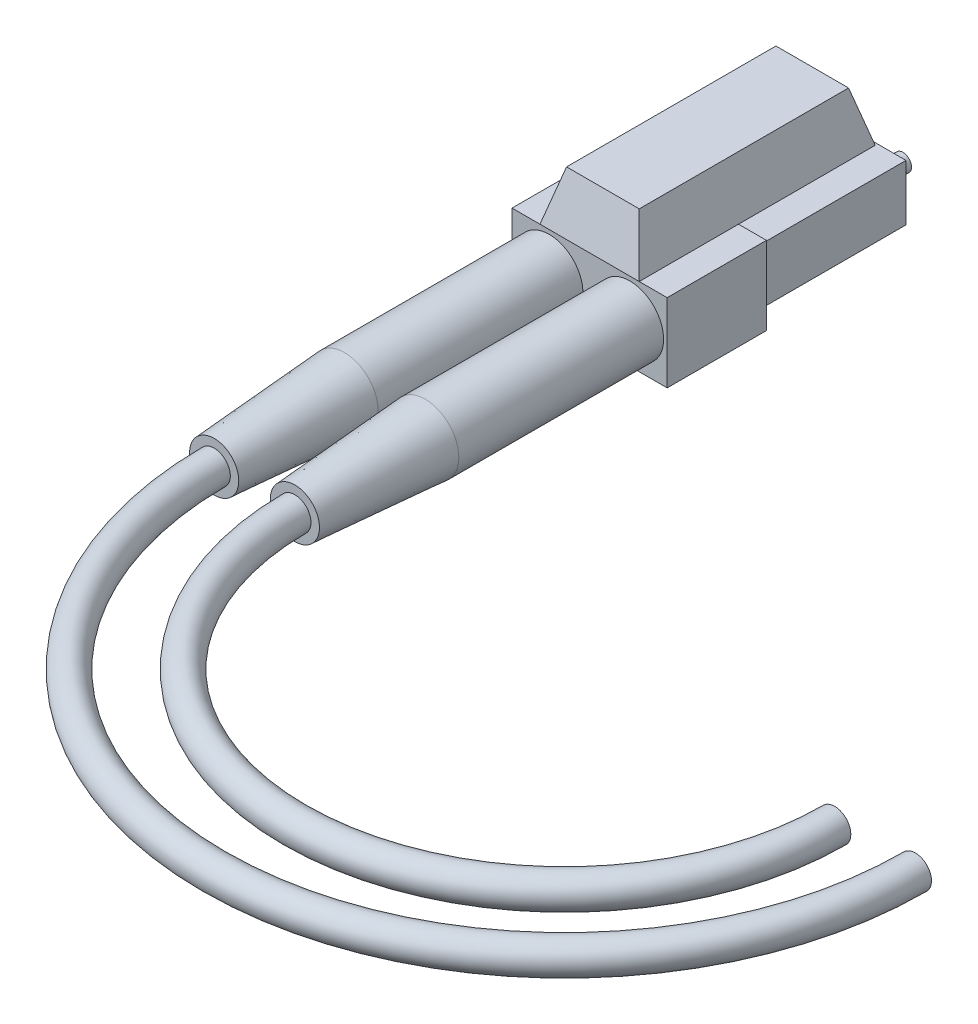
ISO-10303-21;
HEADER;
FILE_DESCRIPTION(('STEP AP214'),'2;1');
FILE_NAME('part.step','',(''),(''),'','','');
FILE_SCHEMA(('AUTOMOTIVE_DESIGN { 1 0 10303 214 1 1 1 1 }'));
ENDSEC;
DATA;
#1=APPLICATION_CONTEXT('core data for automotive mechanical design processes');
#2=APPLICATION_PROTOCOL_DEFINITION('international standard','automotive_design',2000,#1);
#3=PRODUCT_CONTEXT('',#1,'mechanical');
#4=PRODUCT('Part','Part','',(#3));
#5=PRODUCT_RELATED_PRODUCT_CATEGORY('part','',(#4));
#6=PRODUCT_DEFINITION_FORMATION('','',#4);
#7=PRODUCT_DEFINITION_CONTEXT('part definition',#1,'design');
#8=PRODUCT_DEFINITION('design','',#6,#7);
#9=PRODUCT_DEFINITION_SHAPE('','',#8);
#10=(LENGTH_UNIT() NAMED_UNIT(*) SI_UNIT(.MILLI.,.METRE.));
#11=(NAMED_UNIT(*) PLANE_ANGLE_UNIT() SI_UNIT($,.RADIAN.));
#12=(NAMED_UNIT(*) SI_UNIT($,.STERADIAN.) SOLID_ANGLE_UNIT());
#13=UNCERTAINTY_MEASURE_WITH_UNIT(LENGTH_MEASURE(1.E-05),#10,'distance_accuracy_value','');
#14=(GEOMETRIC_REPRESENTATION_CONTEXT(3) GLOBAL_UNCERTAINTY_ASSIGNED_CONTEXT((#13)) GLOBAL_UNIT_ASSIGNED_CONTEXT((#10,
#11,#12)) REPRESENTATION_CONTEXT('',''));
#15=CARTESIAN_POINT('',(0.,0.,0.));
#16=DIRECTION('',(0.,0.,1.));
#17=DIRECTION('',(1.,0.,0.));
#18=AXIS2_PLACEMENT_3D('',#15,#16,#17);
#19=CARTESIAN_POINT('',(-6.25,5.3,8.));
#20=DIRECTION('',(0.,1.,0.));
#21=DIRECTION('',(0.,0.,1.));
#22=AXIS2_PLACEMENT_3D('',#19,#20,#21);
#23=PLANE('',#22);
#24=DIRECTION('',(0.,0.,-1.));
#25=VECTOR('',#24,1.);
#26=CARTESIAN_POINT('',(4.,5.3,8.));
#27=LINE('',#26,#25);
#28=CARTESIAN_POINT('',(4.,5.3,8.));
#29=VERTEX_POINT('',#28);
#30=CARTESIAN_POINT('',(4.,5.3,0.));
#31=VERTEX_POINT('',#30);
#32=EDGE_CURVE('E49',#29,#31,#27,.T.);
#33=ORIENTED_EDGE('',*,*,#32,.F.);
#34=DIRECTION('',(1.,0.,0.));
#35=VECTOR('',#34,1.);
#36=CARTESIAN_POINT('',(-6.25,5.3,8.));
#37=LINE('',#36,#35);
#38=CARTESIAN_POINT('',(6.25,5.3,8.));
#39=VERTEX_POINT('',#38);
#40=EDGE_CURVE('E245',#29,#39,#37,.T.);
#41=ORIENTED_EDGE('',*,*,#40,.T.);
#42=DIRECTION('',(0.,0.,-1.));
#43=VECTOR('',#42,1.);
#44=CARTESIAN_POINT('',(6.25,5.3,8.));
#45=LINE('',#44,#43);
#46=CARTESIAN_POINT('',(6.25,5.3,0.));
#47=VERTEX_POINT('',#46);
#48=EDGE_CURVE('E306',#39,#47,#45,.T.);
#49=ORIENTED_EDGE('',*,*,#48,.T.);
#50=DIRECTION('',(1.,0.,0.));
#51=VECTOR('',#50,1.);
#52=CARTESIAN_POINT('',(-6.25,5.3,0.));
#53=LINE('',#52,#51);
#54=EDGE_CURVE('E54',#31,#47,#53,.T.);
#55=ORIENTED_EDGE('',*,*,#54,.F.);
#56=EDGE_LOOP('',(#33,#41,#49,#55));
#57=FACE_BOUND('',#56,.T.);
#58=ADVANCED_FACE('F32',(#57),#23,.T.);
#59=CARTESIAN_POINT('',(0.,0.,8.));
#60=DIRECTION('',(0.,0.,-1.));
#61=DIRECTION('',(-1.,0.,0.));
#62=AXIS2_PLACEMENT_3D('',#59,#60,#61);
#63=PLANE('',#62);
#64=CARTESIAN_POINT('',(3.25,2.25,8.));
#65=DIRECTION('',(0.,0.,-1.));
#66=DIRECTION('',(-1.,0.,0.));
#67=AXIS2_PLACEMENT_3D('',#64,#65,#66);
#68=CIRCLE('',#67,2.715);
#69=CARTESIAN_POINT('',(0.534999999999999,2.25,8.));
#70=VERTEX_POINT('',#69);
#71=EDGE_CURVE('E261',#70,#70,#68,.F.);
#72=ORIENTED_EDGE('',*,*,#71,.F.);
#73=EDGE_LOOP('',(#72));
#74=FACE_BOUND('',#73,.T.);
#75=DIRECTION('',(0.,1.,0.));
#76=VECTOR('',#75,1.);
#77=CARTESIAN_POINT('',(-6.25,-1.,8.));
#78=LINE('',#77,#76);
#79=CARTESIAN_POINT('',(-6.25,-1.,8.));
#80=VERTEX_POINT('',#79);
#81=CARTESIAN_POINT('',(-6.25,5.3,8.));
#82=VERTEX_POINT('',#81);
#83=EDGE_CURVE('E242',#80,#82,#78,.T.);
#84=ORIENTED_EDGE('',*,*,#83,.F.);
#85=DIRECTION('',(1.,0.,0.));
#86=VECTOR('',#85,1.);
#87=CARTESIAN_POINT('',(-6.25,-1.,8.));
#88=LINE('',#87,#86);
#89=CARTESIAN_POINT('',(6.25,-1.,8.));
#90=VERTEX_POINT('',#89);
#91=EDGE_CURVE('E307',#80,#90,#88,.T.);
#92=ORIENTED_EDGE('',*,*,#91,.T.);
#93=DIRECTION('',(0.,1.,0.));
#94=VECTOR('',#93,1.);
#95=CARTESIAN_POINT('',(6.25,-1.,8.));
#96=LINE('',#95,#94);
#97=EDGE_CURVE('E249',#90,#39,#96,.T.);
#98=ORIENTED_EDGE('',*,*,#97,.T.);
#99=ORIENTED_EDGE('',*,*,#40,.F.);
#100=DIRECTION('',(1.,0.,0.));
#101=VECTOR('',#100,1.);
#102=CARTESIAN_POINT('',(4.,5.3,8.));
#103=LINE('',#102,#101);
#104=CARTESIAN_POINT('',(-4.,5.3,8.));
#105=VERTEX_POINT('',#104);
#106=EDGE_CURVE('E188',#105,#29,#103,.T.);
#107=ORIENTED_EDGE('',*,*,#106,.F.);
#108=EDGE_CURVE('E255',#82,#105,#37,.T.);
#109=ORIENTED_EDGE('',*,*,#108,.F.);
#110=EDGE_LOOP('',(#84,#92,#98,#99,#107,#109));
#111=FACE_BOUND('',#110,.T.);
#112=CARTESIAN_POINT('',(-3.25,2.25,8.));
#113=DIRECTION('',(0.,0.,-1.));
#114=DIRECTION('',(-1.,0.,0.));
#115=AXIS2_PLACEMENT_3D('',#112,#113,#114);
#116=CIRCLE('',#115,2.715);
#117=CARTESIAN_POINT('',(-5.965,2.25,8.));
#118=VERTEX_POINT('',#117);
#119=EDGE_CURVE('E257',#118,#118,#116,.F.);
#120=ORIENTED_EDGE('',*,*,#119,.F.);
#121=EDGE_LOOP('',(#120));
#122=FACE_BOUND('',#121,.T.);
#123=ADVANCED_FACE('F329',(#74,#111,#122),#63,.F.);
#124=CARTESIAN_POINT('',(0.,0.,-12.));
#125=DIRECTION('',(0.,0.,1.));
#126=DIRECTION('',(1.,0.,0.));
#127=AXIS2_PLACEMENT_3D('',#124,#125,#126);
#128=PLANE('',#127);
#129=DIRECTION('',(0.,-1.,0.));
#130=VECTOR('',#129,1.);
#131=CARTESIAN_POINT('',(-5.50406156193178,4.5,-12.));
#132=LINE('',#131,#130);
#133=CARTESIAN_POINT('',(-5.50406156193178,4.5,-12.));
#134=VERTEX_POINT('',#133);
#135=CARTESIAN_POINT('',(-5.50406156193178,0.,-12.));
#136=VERTEX_POINT('',#135);
#137=EDGE_CURVE('E280',#134,#136,#132,.T.);
#138=ORIENTED_EDGE('',*,*,#137,.F.);
#139=DIRECTION('',(-1.,0.,0.));
#140=VECTOR('',#139,1.);
#141=CARTESIAN_POINT('',(-5.50406156193178,4.5,-12.));
#142=LINE('',#141,#140);
#143=CARTESIAN_POINT('',(-1.00406156193187,4.5,-12.));
#144=VERTEX_POINT('',#143);
#145=EDGE_CURVE('E271',#144,#134,#142,.T.);
#146=ORIENTED_EDGE('',*,*,#145,.F.);
#147=DIRECTION('',(0.,1.,0.));
#148=VECTOR('',#147,1.);
#149=CARTESIAN_POINT('',(-1.00406156193187,4.5,-12.));
#150=LINE('',#149,#148);
#151=CARTESIAN_POINT('',(-1.00406156193187,0.,-12.));
#152=VERTEX_POINT('',#151);
#153=EDGE_CURVE('E293',#152,#144,#150,.T.);
#154=ORIENTED_EDGE('',*,*,#153,.F.);
#155=DIRECTION('',(1.,0.,0.));
#156=VECTOR('',#155,1.);
#157=CARTESIAN_POINT('',(-5.50406156193178,0.,-12.));
#158=LINE('',#157,#156);
#159=EDGE_CURVE('E296',#136,#152,#158,.T.);
#160=ORIENTED_EDGE('',*,*,#159,.F.);
#161=EDGE_LOOP('',(#138,#146,#154,#160));
#162=FACE_BOUND('',#161,.T.);
#163=CARTESIAN_POINT('',(-3.25,2.25,-12.));
#164=DIRECTION('',(0.,0.,1.));
#165=DIRECTION('',(1.,0.,0.));
#166=AXIS2_PLACEMENT_3D('',#163,#164,#165);
#167=CIRCLE('',#166,0.691748061692724);
#168=CARTESIAN_POINT('',(-2.55825193830728,2.25,-12.));
#169=VERTEX_POINT('',#168);
#170=EDGE_CURVE('E264',#169,#169,#167,.F.);
#171=ORIENTED_EDGE('',*,*,#170,.F.);
#172=EDGE_LOOP('',(#171));
#173=FACE_BOUND('',#172,.T.);
#174=ADVANCED_FACE('F342',(#162,#173),#128,.F.);
#175=CARTESIAN_POINT('',(-5.50406156193178,4.5,-12.));
#176=DIRECTION('',(-1.,0.,0.));
#177=DIRECTION('',(0.,0.,1.));
#178=AXIS2_PLACEMENT_3D('',#175,#176,#177);
#179=PLANE('',#178);
#180=DIRECTION('',(0.,-1.,0.));
#181=VECTOR('',#180,1.);
#182=CARTESIAN_POINT('',(-5.50406156193178,4.5,0.));
#183=LINE('',#182,#181);
#184=CARTESIAN_POINT('',(-5.50406156193178,4.5,0.));
#185=VERTEX_POINT('',#184);
#186=CARTESIAN_POINT('',(-5.50406156193178,0.,0.));
#187=VERTEX_POINT('',#186);
#188=EDGE_CURVE('E287',#185,#187,#183,.T.);
#189=ORIENTED_EDGE('',*,*,#188,.F.);
#190=DIRECTION('',(0.,0.,1.));
#191=VECTOR('',#190,1.);
#192=CARTESIAN_POINT('',(-5.50406156193178,4.5,-12.));
#193=LINE('',#192,#191);
#194=EDGE_CURVE('E267',#134,#185,#193,.T.);
#195=ORIENTED_EDGE('',*,*,#194,.F.);
#196=ORIENTED_EDGE('',*,*,#137,.T.);
#197=DIRECTION('',(0.,0.,1.));
#198=VECTOR('',#197,1.);
#199=CARTESIAN_POINT('',(-5.50406156193178,0.,-12.));
#200=LINE('',#199,#198);
#201=EDGE_CURVE('E268',#136,#187,#200,.T.);
#202=ORIENTED_EDGE('',*,*,#201,.T.);
#203=EDGE_LOOP('',(#189,#195,#196,#202));
#204=FACE_BOUND('',#203,.T.);
#205=ADVANCED_FACE('F34',(#204),#179,.T.);
#206=CARTESIAN_POINT('',(-5.50406156193178,4.5,-12.));
#207=DIRECTION('',(0.,1.,0.));
#208=DIRECTION('',(0.,0.,1.));
#209=AXIS2_PLACEMENT_3D('',#206,#207,#208);
#210=PLANE('',#209);
#211=DIRECTION('',(-1.,0.,0.));
#212=VECTOR('',#211,1.);
#213=CARTESIAN_POINT('',(-5.50406156193178,4.5,0.));
#214=LINE('',#213,#212);
#215=CARTESIAN_POINT('',(-1.00406156193187,4.5,0.));
#216=VERTEX_POINT('',#215);
#217=EDGE_CURVE('E277',#216,#185,#214,.T.);
#218=ORIENTED_EDGE('',*,*,#217,.F.);
#219=DIRECTION('',(0.,0.,1.));
#220=VECTOR('',#219,1.);
#221=CARTESIAN_POINT('',(-1.00406156193187,4.5,-12.));
#222=LINE('',#221,#220);
#223=EDGE_CURVE('E274',#144,#216,#222,.T.);
#224=ORIENTED_EDGE('',*,*,#223,.F.);
#225=ORIENTED_EDGE('',*,*,#145,.T.);
#226=ORIENTED_EDGE('',*,*,#194,.T.);
#227=EDGE_LOOP('',(#218,#224,#225,#226));
#228=FACE_BOUND('',#227,.T.);
#229=ADVANCED_FACE('F473',(#228),#210,.T.);
#230=CARTESIAN_POINT('',(-1.00406156193187,4.5,-12.));
#231=DIRECTION('',(1.,0.,0.));
#232=DIRECTION('',(0.,1.,0.));
#233=AXIS2_PLACEMENT_3D('',#230,#231,#232);
#234=PLANE('',#233);
#235=DIRECTION('',(0.,1.,0.));
#236=VECTOR('',#235,1.);
#237=CARTESIAN_POINT('',(-1.00406156193187,4.5,0.));
#238=LINE('',#237,#236);
#239=CARTESIAN_POINT('',(-1.00406156193187,0.,0.));
#240=VERTEX_POINT('',#239);
#241=EDGE_CURVE('E281',#240,#216,#238,.T.);
#242=ORIENTED_EDGE('',*,*,#241,.F.);
#243=DIRECTION('',(0.,0.,1.));
#244=VECTOR('',#243,1.);
#245=CARTESIAN_POINT('',(-1.00406156193187,0.,-12.));
#246=LINE('',#245,#244);
#247=EDGE_CURVE('E270',#152,#240,#246,.T.);
#248=ORIENTED_EDGE('',*,*,#247,.F.);
#249=ORIENTED_EDGE('',*,*,#153,.T.);
#250=ORIENTED_EDGE('',*,*,#223,.T.);
#251=EDGE_LOOP('',(#242,#248,#249,#250));
#252=FACE_BOUND('',#251,.T.);
#253=ADVANCED_FACE('F476',(#252),#234,.T.);
#254=CARTESIAN_POINT('',(-5.50406156193178,0.,-12.));
#255=DIRECTION('',(0.,-1.,0.));
#256=DIRECTION('',(0.,0.,-1.));
#257=AXIS2_PLACEMENT_3D('',#254,#255,#256);
#258=PLANE('',#257);
#259=DIRECTION('',(1.,0.,0.));
#260=VECTOR('',#259,1.);
#261=CARTESIAN_POINT('',(-5.50406156193178,0.,0.));
#262=LINE('',#261,#260);
#263=EDGE_CURVE('E284',#187,#240,#262,.T.);
#264=ORIENTED_EDGE('',*,*,#263,.F.);
#265=ORIENTED_EDGE('',*,*,#201,.F.);
#266=ORIENTED_EDGE('',*,*,#159,.T.);
#267=ORIENTED_EDGE('',*,*,#247,.T.);
#268=EDGE_LOOP('',(#264,#265,#266,#267));
#269=FACE_BOUND('',#268,.T.);
#270=ADVANCED_FACE('F468',(#269),#258,.T.);
#271=CARTESIAN_POINT('',(-3.25,2.25,-14.));
#272=DIRECTION('',(0.,0.,1.));
#273=DIRECTION('',(1.,0.,0.));
#274=AXIS2_PLACEMENT_3D('',#271,#272,#273);
#275=CYLINDRICAL_SURFACE('',#274,0.691748061692724);
#276=CARTESIAN_POINT('',(-3.25,2.25,-14.));
#277=DIRECTION('',(0.,0.,-1.));
#278=DIRECTION('',(-1.,0.,0.));
#279=AXIS2_PLACEMENT_3D('',#276,#277,#278);
#280=CIRCLE('',#279,0.691748061692724);
#281=CARTESIAN_POINT('',(-3.94174806169272,2.25,-14.));
#282=VERTEX_POINT('',#281);
#283=EDGE_CURVE('E290',#282,#282,#280,.T.);
#284=ORIENTED_EDGE('',*,*,#283,.F.);
#285=EDGE_LOOP('',(#284));
#286=FACE_BOUND('',#285,.T.);
#287=ORIENTED_EDGE('',*,*,#170,.T.);
#288=EDGE_LOOP('',(#287));
#289=FACE_BOUND('',#288,.T.);
#290=ADVANCED_FACE('F462',(#286,#289),#275,.T.);
#291=CARTESIAN_POINT('',(-3.25,2.25,-14.));
#292=DIRECTION('',(0.,0.,-1.));
#293=DIRECTION('',(-1.,0.,0.));
#294=AXIS2_PLACEMENT_3D('',#291,#292,#293);
#295=PLANE('',#294);
#296=ORIENTED_EDGE('',*,*,#283,.T.);
#297=EDGE_LOOP('',(#296));
#298=FACE_BOUND('',#297,.T.);
#299=ADVANCED_FACE('F457',(#298),#295,.T.);
#300=CARTESIAN_POINT('',(-6.25,-1.,8.));
#301=DIRECTION('',(-1.,0.,0.));
#302=DIRECTION('',(0.,0.,1.));
#303=AXIS2_PLACEMENT_3D('',#300,#301,#302);
#304=PLANE('',#303);
#305=DIRECTION('',(0.,1.,0.));
#306=VECTOR('',#305,1.);
#307=CARTESIAN_POINT('',(-6.25,-1.,0.));
#308=LINE('',#307,#306);
#309=CARTESIAN_POINT('',(-6.25,-1.,0.));
#310=VERTEX_POINT('',#309);
#311=CARTESIAN_POINT('',(-6.25,5.3,0.));
#312=VERTEX_POINT('',#311);
#313=EDGE_CURVE('E241',#310,#312,#308,.T.);
#314=ORIENTED_EDGE('',*,*,#313,.F.);
#315=DIRECTION('',(0.,0.,-1.));
#316=VECTOR('',#315,1.);
#317=CARTESIAN_POINT('',(-6.25,-1.,8.));
#318=LINE('',#317,#316);
#319=EDGE_CURVE('E303',#80,#310,#318,.T.);
#320=ORIENTED_EDGE('',*,*,#319,.F.);
#321=ORIENTED_EDGE('',*,*,#83,.T.);
#322=DIRECTION('',(0.,0.,-1.));
#323=VECTOR('',#322,1.);
#324=CARTESIAN_POINT('',(-6.25,5.3,8.));
#325=LINE('',#324,#323);
#326=EDGE_CURVE('E304',#82,#312,#325,.T.);
#327=ORIENTED_EDGE('',*,*,#326,.T.);
#328=EDGE_LOOP('',(#314,#320,#321,#327));
#329=FACE_BOUND('',#328,.T.);
#330=ADVANCED_FACE('F452',(#329),#304,.T.);
#331=CARTESIAN_POINT('',(-6.25,-1.,8.));
#332=DIRECTION('',(0.,1.,0.));
#333=DIRECTION('',(0.,0.,1.));
#334=AXIS2_PLACEMENT_3D('',#331,#332,#333);
#335=PLANE('',#334);
#336=DIRECTION('',(1.,0.,0.));
#337=VECTOR('',#336,1.);
#338=CARTESIAN_POINT('',(-6.25,-1.,0.));
#339=LINE('',#338,#337);
#340=CARTESIAN_POINT('',(6.25,-1.,0.));
#341=VERTEX_POINT('',#340);
#342=EDGE_CURVE('E246',#310,#341,#339,.T.);
#343=ORIENTED_EDGE('',*,*,#342,.T.);
#344=DIRECTION('',(0.,0.,-1.));
#345=VECTOR('',#344,1.);
#346=CARTESIAN_POINT('',(6.25,-1.,8.));
#347=LINE('',#346,#345);
#348=EDGE_CURVE('E309',#90,#341,#347,.T.);
#349=ORIENTED_EDGE('',*,*,#348,.F.);
#350=ORIENTED_EDGE('',*,*,#91,.F.);
#351=ORIENTED_EDGE('',*,*,#319,.T.);
#352=EDGE_LOOP('',(#343,#349,#350,#351));
#353=FACE_BOUND('',#352,.T.);
#354=ADVANCED_FACE('F357',(#353),#335,.F.);
#355=CARTESIAN_POINT('',(6.25,-1.,8.));
#356=DIRECTION('',(-1.,0.,0.));
#357=DIRECTION('',(0.,0.,1.));
#358=AXIS2_PLACEMENT_3D('',#355,#356,#357);
#359=PLANE('',#358);
#360=DIRECTION('',(0.,1.,0.));
#361=VECTOR('',#360,1.);
#362=CARTESIAN_POINT('',(6.25,-1.,0.));
#363=LINE('',#362,#361);
#364=EDGE_CURVE('E314',#341,#47,#363,.T.);
#365=ORIENTED_EDGE('',*,*,#364,.T.);
#366=ORIENTED_EDGE('',*,*,#48,.F.);
#367=ORIENTED_EDGE('',*,*,#97,.F.);
#368=ORIENTED_EDGE('',*,*,#348,.T.);
#369=EDGE_LOOP('',(#365,#366,#367,#368));
#370=FACE_BOUND('',#369,.T.);
#371=ADVANCED_FACE('F334',(#370),#359,.F.);
#372=DIRECTION('',(0.,0.,1.));
#373=VECTOR('',#372,1.);
#374=CARTESIAN_POINT('',(-4.,5.3,8.));
#375=LINE('',#374,#373);
#376=CARTESIAN_POINT('',(-4.,5.3,0.));
#377=VERTEX_POINT('',#376);
#378=EDGE_CURVE('E260',#377,#105,#375,.T.);
#379=ORIENTED_EDGE('',*,*,#378,.F.);
#380=EDGE_CURVE('E317',#312,#377,#53,.T.);
#381=ORIENTED_EDGE('',*,*,#380,.F.);
#382=ORIENTED_EDGE('',*,*,#326,.F.);
#383=ORIENTED_EDGE('',*,*,#108,.T.);
#384=EDGE_LOOP('',(#379,#381,#382,#383));
#385=FACE_BOUND('',#384,.T.);
#386=ADVANCED_FACE('F338',(#385),#23,.T.);
#387=CARTESIAN_POINT('',(0.,0.,0.));
#388=DIRECTION('',(0.,0.,-1.));
#389=DIRECTION('',(-1.,0.,0.));
#390=AXIS2_PLACEMENT_3D('',#387,#388,#389);
#391=PLANE('',#390);
#392=DIRECTION('',(0.,-1.,0.));
#393=VECTOR('',#392,1.);
#394=CARTESIAN_POINT('',(0.995938438068224,4.5,0.));
#395=LINE('',#394,#393);
#396=CARTESIAN_POINT('',(0.995938438068224,4.5,0.));
#397=VERTEX_POINT('',#396);
#398=CARTESIAN_POINT('',(0.995938438068224,0.,0.));
#399=VERTEX_POINT('',#398);
#400=EDGE_CURVE('E206',#397,#399,#395,.T.);
#401=ORIENTED_EDGE('',*,*,#400,.T.);
#402=DIRECTION('',(1.,0.,0.));
#403=VECTOR('',#402,1.);
#404=CARTESIAN_POINT('',(0.995938438068224,0.,0.));
#405=LINE('',#404,#403);
#406=CARTESIAN_POINT('',(5.49593843806813,0.,0.));
#407=VERTEX_POINT('',#406);
#408=EDGE_CURVE('E222',#399,#407,#405,.T.);
#409=ORIENTED_EDGE('',*,*,#408,.T.);
#410=DIRECTION('',(0.,1.,0.));
#411=VECTOR('',#410,1.);
#412=CARTESIAN_POINT('',(5.49593843806813,4.5,0.));
#413=LINE('',#412,#411);
#414=CARTESIAN_POINT('',(5.49593843806813,4.5,0.));
#415=VERTEX_POINT('',#414);
#416=EDGE_CURVE('E224',#407,#415,#413,.T.);
#417=ORIENTED_EDGE('',*,*,#416,.T.);
#418=DIRECTION('',(-1.,0.,0.));
#419=VECTOR('',#418,1.);
#420=CARTESIAN_POINT('',(0.995938438068224,4.5,0.));
#421=LINE('',#420,#419);
#422=EDGE_CURVE('E211',#415,#397,#421,.T.);
#423=ORIENTED_EDGE('',*,*,#422,.T.);
#424=EDGE_LOOP('',(#401,#409,#417,#423));
#425=FACE_BOUND('',#424,.T.);
#426=ORIENTED_EDGE('',*,*,#217,.T.);
#427=ORIENTED_EDGE('',*,*,#188,.T.);
#428=ORIENTED_EDGE('',*,*,#263,.T.);
#429=ORIENTED_EDGE('',*,*,#241,.T.);
#430=EDGE_LOOP('',(#426,#427,#428,#429));
#431=FACE_BOUND('',#430,.T.);
#432=ORIENTED_EDGE('',*,*,#313,.T.);
#433=ORIENTED_EDGE('',*,*,#380,.T.);
#434=EDGE_CURVE('E320',#377,#31,#53,.T.);
#435=ORIENTED_EDGE('',*,*,#434,.T.);
#436=ORIENTED_EDGE('',*,*,#54,.T.);
#437=ORIENTED_EDGE('',*,*,#364,.F.);
#438=ORIENTED_EDGE('',*,*,#342,.F.);
#439=EDGE_LOOP('',(#432,#433,#435,#436,#437,#438));
#440=FACE_BOUND('',#439,.T.);
#441=ADVANCED_FACE('F348',(#425,#431,#440),#391,.T.);
#442=CARTESIAN_POINT('',(0.,0.,-12.));
#443=DIRECTION('',(0.,0.,1.));
#444=DIRECTION('',(1.,0.,0.));
#445=AXIS2_PLACEMENT_3D('',#442,#443,#444);
#446=PLANE('',#445);
#447=DIRECTION('',(0.,-1.,0.));
#448=VECTOR('',#447,1.);
#449=CARTESIAN_POINT('',(0.995938438068224,4.5,-12.));
#450=LINE('',#449,#448);
#451=CARTESIAN_POINT('',(0.995938438068224,4.5,-12.));
#452=VERTEX_POINT('',#451);
#453=CARTESIAN_POINT('',(0.995938438068224,0.,-12.));
#454=VERTEX_POINT('',#453);
#455=EDGE_CURVE('E207',#452,#454,#450,.T.);
#456=ORIENTED_EDGE('',*,*,#455,.F.);
#457=DIRECTION('',(-1.,0.,0.));
#458=VECTOR('',#457,1.);
#459=CARTESIAN_POINT('',(0.995938438068224,4.5,-12.));
#460=LINE('',#459,#458);
#461=CARTESIAN_POINT('',(5.49593843806813,4.5,-12.));
#462=VERTEX_POINT('',#461);
#463=EDGE_CURVE('E217',#462,#452,#460,.T.);
#464=ORIENTED_EDGE('',*,*,#463,.F.);
#465=DIRECTION('',(0.,1.,0.));
#466=VECTOR('',#465,1.);
#467=CARTESIAN_POINT('',(5.49593843806813,4.5,-12.));
#468=LINE('',#467,#466);
#469=CARTESIAN_POINT('',(5.49593843806813,0.,-12.));
#470=VERTEX_POINT('',#469);
#471=EDGE_CURVE('E214',#470,#462,#468,.T.);
#472=ORIENTED_EDGE('',*,*,#471,.F.);
#473=DIRECTION('',(1.,0.,0.));
#474=VECTOR('',#473,1.);
#475=CARTESIAN_POINT('',(0.995938438068224,0.,-12.));
#476=LINE('',#475,#474);
#477=EDGE_CURVE('E210',#454,#470,#476,.T.);
#478=ORIENTED_EDGE('',*,*,#477,.F.);
#479=EDGE_LOOP('',(#456,#464,#472,#478));
#480=FACE_BOUND('',#479,.T.);
#481=CARTESIAN_POINT('',(3.25,2.25,-12.));
#482=DIRECTION('',(0.,0.,1.));
#483=DIRECTION('',(1.,0.,0.));
#484=AXIS2_PLACEMENT_3D('',#481,#482,#483);
#485=CIRCLE('',#484,0.691748061692723);
#486=CARTESIAN_POINT('',(3.94174806169272,2.25,-12.));
#487=VERTEX_POINT('',#486);
#488=EDGE_CURVE('E230',#487,#487,#485,.F.);
#489=ORIENTED_EDGE('',*,*,#488,.F.);
#490=EDGE_LOOP('',(#489));
#491=FACE_BOUND('',#490,.T.);
#492=ADVANCED_FACE('F354',(#480,#491),#446,.F.);
#493=CARTESIAN_POINT('',(0.995938438068224,4.5,-12.));
#494=DIRECTION('',(-1.,0.,0.));
#495=DIRECTION('',(0.,0.,1.));
#496=AXIS2_PLACEMENT_3D('',#493,#494,#495);
#497=PLANE('',#496);
#498=ORIENTED_EDGE('',*,*,#400,.F.);
#499=DIRECTION('',(0.,0.,1.));
#500=VECTOR('',#499,1.);
#501=CARTESIAN_POINT('',(0.995938438068224,4.5,-12.));
#502=LINE('',#501,#500);
#503=EDGE_CURVE('E227',#452,#397,#502,.T.);
#504=ORIENTED_EDGE('',*,*,#503,.F.);
#505=ORIENTED_EDGE('',*,*,#455,.T.);
#506=DIRECTION('',(0.,0.,1.));
#507=VECTOR('',#506,1.);
#508=CARTESIAN_POINT('',(0.995938438068224,0.,-12.));
#509=LINE('',#508,#507);
#510=EDGE_CURVE('E220',#454,#399,#509,.T.);
#511=ORIENTED_EDGE('',*,*,#510,.T.);
#512=EDGE_LOOP('',(#498,#504,#505,#511));
#513=FACE_BOUND('',#512,.T.);
#514=ADVANCED_FACE('F435',(#513),#497,.T.);
#515=CARTESIAN_POINT('',(0.995938438068224,4.5,-12.));
#516=DIRECTION('',(0.,1.,0.));
#517=DIRECTION('',(0.,0.,1.));
#518=AXIS2_PLACEMENT_3D('',#515,#516,#517);
#519=PLANE('',#518);
#520=ORIENTED_EDGE('',*,*,#422,.F.);
#521=DIRECTION('',(0.,0.,1.));
#522=VECTOR('',#521,1.);
#523=CARTESIAN_POINT('',(5.49593843806813,4.5,-12.));
#524=LINE('',#523,#522);
#525=EDGE_CURVE('E231',#462,#415,#524,.T.);
#526=ORIENTED_EDGE('',*,*,#525,.F.);
#527=ORIENTED_EDGE('',*,*,#463,.T.);
#528=ORIENTED_EDGE('',*,*,#503,.T.);
#529=EDGE_LOOP('',(#520,#526,#527,#528));
#530=FACE_BOUND('',#529,.T.);
#531=ADVANCED_FACE('F437',(#530),#519,.T.);
#532=CARTESIAN_POINT('',(5.49593843806813,4.5,-12.));
#533=DIRECTION('',(1.,0.,0.));
#534=DIRECTION('',(0.,1.,0.));
#535=AXIS2_PLACEMENT_3D('',#532,#533,#534);
#536=PLANE('',#535);
#537=ORIENTED_EDGE('',*,*,#416,.F.);
#538=DIRECTION('',(0.,0.,1.));
#539=VECTOR('',#538,1.);
#540=CARTESIAN_POINT('',(5.49593843806813,0.,-12.));
#541=LINE('',#540,#539);
#542=EDGE_CURVE('E234',#470,#407,#541,.T.);
#543=ORIENTED_EDGE('',*,*,#542,.F.);
#544=ORIENTED_EDGE('',*,*,#471,.T.);
#545=ORIENTED_EDGE('',*,*,#525,.T.);
#546=EDGE_LOOP('',(#537,#543,#544,#545));
#547=FACE_BOUND('',#546,.T.);
#548=ADVANCED_FACE('F440',(#547),#536,.T.);
#549=CARTESIAN_POINT('',(0.995938438068224,0.,-12.));
#550=DIRECTION('',(0.,-1.,0.));
#551=DIRECTION('',(0.,0.,-1.));
#552=AXIS2_PLACEMENT_3D('',#549,#550,#551);
#553=PLANE('',#552);
#554=ORIENTED_EDGE('',*,*,#408,.F.);
#555=ORIENTED_EDGE('',*,*,#510,.F.);
#556=ORIENTED_EDGE('',*,*,#477,.T.);
#557=ORIENTED_EDGE('',*,*,#542,.T.);
#558=EDGE_LOOP('',(#554,#555,#556,#557));
#559=FACE_BOUND('',#558,.T.);
#560=ADVANCED_FACE('F431',(#559),#553,.T.);
#561=CARTESIAN_POINT('',(3.25,2.25,-14.));
#562=DIRECTION('',(0.,0.,1.));
#563=DIRECTION('',(1.,0.,0.));
#564=AXIS2_PLACEMENT_3D('',#561,#562,#563);
#565=CYLINDRICAL_SURFACE('',#564,0.691748061692723);
#566=CARTESIAN_POINT('',(3.25,2.25,-14.));
#567=DIRECTION('',(0.,0.,-1.));
#568=DIRECTION('',(-1.,0.,0.));
#569=AXIS2_PLACEMENT_3D('',#566,#567,#568);
#570=CIRCLE('',#569,0.691748061692723);
#571=CARTESIAN_POINT('',(2.55825193830728,2.25,-14.));
#572=VERTEX_POINT('',#571);
#573=EDGE_CURVE('E203',#572,#572,#570,.T.);
#574=ORIENTED_EDGE('',*,*,#573,.F.);
#575=EDGE_LOOP('',(#574));
#576=FACE_BOUND('',#575,.T.);
#577=ORIENTED_EDGE('',*,*,#488,.T.);
#578=EDGE_LOOP('',(#577));
#579=FACE_BOUND('',#578,.T.);
#580=ADVANCED_FACE('F424',(#576,#579),#565,.T.);
#581=CARTESIAN_POINT('',(3.25,2.25,-14.));
#582=DIRECTION('',(0.,0.,-1.));
#583=DIRECTION('',(-1.,0.,0.));
#584=AXIS2_PLACEMENT_3D('',#581,#582,#583);
#585=PLANE('',#584);
#586=ORIENTED_EDGE('',*,*,#573,.T.);
#587=EDGE_LOOP('',(#586));
#588=FACE_BOUND('',#587,.T.);
#589=ADVANCED_FACE('F414',(#588),#585,.T.);
#590=CARTESIAN_POINT('',(3.25,2.25,24.5));
#591=DIRECTION('',(0.,0.,-1.));
#592=DIRECTION('',(-1.,0.,0.));
#593=AXIS2_PLACEMENT_3D('',#590,#591,#592);
#594=CYLINDRICAL_SURFACE('',#593,2.715);
#595=CARTESIAN_POINT('',(3.25,2.25,24.5));
#596=DIRECTION('',(0.,0.,1.));
#597=DIRECTION('',(1.,0.,0.));
#598=AXIS2_PLACEMENT_3D('',#595,#596,#597);
#599=CIRCLE('',#598,2.715);
#600=CARTESIAN_POINT('',(5.965,2.25,24.5));
#601=VERTEX_POINT('',#600);
#602=EDGE_CURVE('E200',#601,#601,#599,.T.);
#603=ORIENTED_EDGE('',*,*,#602,.F.);
#604=EDGE_LOOP('',(#603));
#605=FACE_BOUND('',#604,.T.);
#606=ORIENTED_EDGE('',*,*,#71,.T.);
#607=EDGE_LOOP('',(#606));
#608=FACE_BOUND('',#607,.T.);
#609=ADVANCED_FACE('F410',(#605,#608),#594,.T.);
#610=CARTESIAN_POINT('',(-3.25,2.25,24.5));
#611=DIRECTION('',(0.,0.,-1.));
#612=DIRECTION('',(-1.,0.,0.));
#613=AXIS2_PLACEMENT_3D('',#610,#611,#612);
#614=CYLINDRICAL_SURFACE('',#613,2.715);
#615=CARTESIAN_POINT('',(-3.25,2.25,24.5));
#616=DIRECTION('',(0.,0.,1.));
#617=DIRECTION('',(1.,0.,0.));
#618=AXIS2_PLACEMENT_3D('',#615,#616,#617);
#619=CIRCLE('',#618,2.715);
#620=CARTESIAN_POINT('',(-0.534999999999999,2.25,24.5));
#621=VERTEX_POINT('',#620);
#622=EDGE_CURVE('E197',#621,#621,#619,.T.);
#623=ORIENTED_EDGE('',*,*,#622,.F.);
#624=EDGE_LOOP('',(#623));
#625=FACE_BOUND('',#624,.T.);
#626=ORIENTED_EDGE('',*,*,#119,.T.);
#627=EDGE_LOOP('',(#626));
#628=FACE_BOUND('',#627,.T.);
#629=ADVANCED_FACE('F413',(#625,#628),#614,.T.);
#630=CARTESIAN_POINT('',(-3.25,2.25,24.5));
#631=DIRECTION('',(0.,0.,-1.));
#632=DIRECTION('',(1.,0.,0.));
#633=AXIS2_PLACEMENT_3D('',#630,#631,#632);
#634=CONICAL_SURFACE('',#633,2.715,0.0698131700797733);
#635=CARTESIAN_POINT('',(-3.25,2.25,35.));
#636=DIRECTION('',(0.,0.,1.));
#637=DIRECTION('',(1.,0.,0.));
#638=AXIS2_PLACEMENT_3D('',#635,#636,#637);
#639=CIRCLE('',#638,1.98076847459314);
#640=CARTESIAN_POINT('',(-1.26923152540686,2.25,35.));
#641=VERTEX_POINT('',#640);
#642=EDGE_CURVE('E179',#641,#641,#639,.T.);
#643=ORIENTED_EDGE('',*,*,#642,.F.);
#644=EDGE_LOOP('',(#643));
#645=FACE_BOUND('',#644,.T.);
#646=ORIENTED_EDGE('',*,*,#622,.T.);
#647=EDGE_LOOP('',(#646));
#648=FACE_BOUND('',#647,.T.);
#649=ADVANCED_FACE('F421',(#645,#648),#634,.T.);
#650=CARTESIAN_POINT('',(-3.25,2.25,35.));
#651=DIRECTION('',(0.,0.,1.));
#652=DIRECTION('',(1.,0.,0.));
#653=AXIS2_PLACEMENT_3D('',#650,#651,#652);
#654=PLANE('',#653);
#655=CARTESIAN_POINT('',(-3.25,2.25,35.));
#656=DIRECTION('',(0.,0.,1.));
#657=DIRECTION('',(1.,0.,0.));
#658=AXIS2_PLACEMENT_3D('',#655,#656,#657);
#659=CIRCLE('',#658,1.3);
#660=CARTESIAN_POINT('',(-4.55,2.25,35.));
#661=VERTEX_POINT('',#660);
#662=EDGE_CURVE('E41',#661,#661,#659,.T.);
#663=ORIENTED_EDGE('',*,*,#662,.F.);
#664=EDGE_LOOP('',(#663));
#665=FACE_BOUND('',#664,.T.);
#666=ORIENTED_EDGE('',*,*,#642,.T.);
#667=EDGE_LOOP('',(#666));
#668=FACE_BOUND('',#667,.T.);
#669=ADVANCED_FACE('F406',(#665,#668),#654,.T.);
#670=CARTESIAN_POINT('',(3.25,2.25,24.5));
#671=DIRECTION('',(0.,0.,-1.));
#672=DIRECTION('',(1.,0.,0.));
#673=AXIS2_PLACEMENT_3D('',#670,#671,#672);
#674=CONICAL_SURFACE('',#673,2.715,0.0698131700797733);
#675=CARTESIAN_POINT('',(3.25,2.25,35.));
#676=DIRECTION('',(0.,0.,1.));
#677=DIRECTION('',(1.,0.,0.));
#678=AXIS2_PLACEMENT_3D('',#675,#676,#677);
#679=CIRCLE('',#678,1.98076847459314);
#680=CARTESIAN_POINT('',(5.23076847459314,2.25,35.));
#681=VERTEX_POINT('',#680);
#682=EDGE_CURVE('E175',#681,#681,#679,.T.);
#683=ORIENTED_EDGE('',*,*,#682,.F.);
#684=EDGE_LOOP('',(#683));
#685=FACE_BOUND('',#684,.T.);
#686=ORIENTED_EDGE('',*,*,#602,.T.);
#687=EDGE_LOOP('',(#686));
#688=FACE_BOUND('',#687,.T.);
#689=ADVANCED_FACE('F400',(#685,#688),#674,.T.);
#690=CARTESIAN_POINT('',(3.25,2.25,35.));
#691=DIRECTION('',(0.,0.,1.));
#692=DIRECTION('',(1.,0.,0.));
#693=AXIS2_PLACEMENT_3D('',#690,#691,#692);
#694=PLANE('',#693);
#695=CARTESIAN_POINT('',(3.25,2.25,35.));
#696=DIRECTION('',(0.,0.,1.));
#697=DIRECTION('',(1.,0.,0.));
#698=AXIS2_PLACEMENT_3D('',#695,#696,#697);
#699=CIRCLE('',#698,1.3);
#700=CARTESIAN_POINT('',(1.95,2.25,35.));
#701=VERTEX_POINT('',#700);
#702=EDGE_CURVE('E11',#701,#701,#699,.T.);
#703=ORIENTED_EDGE('',*,*,#702,.F.);
#704=EDGE_LOOP('',(#703));
#705=FACE_BOUND('',#704,.T.);
#706=ORIENTED_EDGE('',*,*,#682,.T.);
#707=EDGE_LOOP('',(#706));
#708=FACE_BOUND('',#707,.T.);
#709=ADVANCED_FACE('F397',(#705,#708),#694,.T.);
#710=CARTESIAN_POINT('',(4.,5.3,8.));
#711=DIRECTION('',(0.965925826289068,0.258819045102521,0.));
#712=DIRECTION('',(-0.258819045102521,0.965925826289068,0.));
#713=AXIS2_PLACEMENT_3D('',#710,#711,#712);
#714=PLANE('',#713);
#715=ORIENTED_EDGE('',*,*,#32,.T.);
#716=CARTESIAN_POINT('',(4.,5.3,-11.0143680516899));
#717=VERTEX_POINT('',#716);
#718=EDGE_CURVE('E152',#31,#717,#27,.T.);
#719=ORIENTED_EDGE('',*,*,#718,.T.);
#720=DIRECTION('',(0.250562807085732,-0.935113126531029,-0.250562807085732));
#721=VECTOR('',#720,1.);
#722=CARTESIAN_POINT('',(4.,5.3,-11.0143680516899));
#723=LINE('',#722,#721);
#724=CARTESIAN_POINT('',(2.92820323027551,9.3,-9.94257128196539));
#725=VERTEX_POINT('',#724);
#726=EDGE_CURVE('E157',#725,#717,#723,.T.);
#727=ORIENTED_EDGE('',*,*,#726,.F.);
#728=DIRECTION('',(0.,0.,1.));
#729=VECTOR('',#728,1.);
#730=CARTESIAN_POINT('',(2.92820323027551,9.3,8.));
#731=LINE('',#730,#729);
#732=CARTESIAN_POINT('',(2.92820323027551,9.3,6.92820323027551));
#733=VERTEX_POINT('',#732);
#734=EDGE_CURVE('E186',#733,#725,#731,.F.);
#735=ORIENTED_EDGE('',*,*,#734,.F.);
#736=DIRECTION('',(0.250562807085732,-0.935113126531029,0.250562807085732));
#737=VECTOR('',#736,1.);
#738=CARTESIAN_POINT('',(4.,5.3,8.));
#739=LINE('',#738,#737);
#740=EDGE_CURVE('E193',#733,#29,#739,.T.);
#741=ORIENTED_EDGE('',*,*,#740,.T.);
#742=EDGE_LOOP('',(#715,#719,#727,#735,#741));
#743=FACE_BOUND('',#742,.T.);
#744=ADVANCED_FACE('F154',(#743),#714,.T.);
#745=CARTESIAN_POINT('',(4.,5.3,-11.0143680516899));
#746=DIRECTION('',(0.,0.258819045102521,-0.965925826289068));
#747=DIRECTION('',(0.,0.965925826289068,0.258819045102521));
#748=AXIS2_PLACEMENT_3D('',#745,#746,#747);
#749=PLANE('',#748);
#750=DIRECTION('',(-1.,0.,0.));
#751=VECTOR('',#750,1.);
#752=CARTESIAN_POINT('',(4.,5.3,-11.0143680516899));
#753=LINE('',#752,#751);
#754=CARTESIAN_POINT('',(-4.,5.3,-11.0143680516899));
#755=VERTEX_POINT('',#754);
#756=EDGE_CURVE('E164',#717,#755,#753,.T.);
#757=ORIENTED_EDGE('',*,*,#756,.T.);
#758=DIRECTION('',(-0.250562807085732,-0.935113126531029,-0.250562807085732));
#759=VECTOR('',#758,1.);
#760=CARTESIAN_POINT('',(-2.80624526339867,9.75515332877215,-9.82061331508855));
#761=LINE('',#760,#759);
#762=CARTESIAN_POINT('',(-2.92820323027551,9.3,-9.94257128196539));
#763=VERTEX_POINT('',#762);
#764=EDGE_CURVE('E176',#763,#755,#761,.T.);
#765=ORIENTED_EDGE('',*,*,#764,.F.);
#766=DIRECTION('',(1.,0.,0.));
#767=VECTOR('',#766,1.);
#768=CARTESIAN_POINT('',(4.,9.3,-9.94257128196539));
#769=LINE('',#768,#767);
#770=EDGE_CURVE('E173',#725,#763,#769,.F.);
#771=ORIENTED_EDGE('',*,*,#770,.F.);
#772=ORIENTED_EDGE('',*,*,#726,.T.);
#773=EDGE_LOOP('',(#757,#765,#771,#772));
#774=FACE_BOUND('',#773,.T.);
#775=ADVANCED_FACE('F172',(#774),#749,.T.);
#776=CARTESIAN_POINT('',(-4.,5.3,8.));
#777=DIRECTION('',(-0.965925826289068,0.258819045102521,0.));
#778=DIRECTION('',(-0.258819045102521,-0.965925826289068,0.));
#779=AXIS2_PLACEMENT_3D('',#776,#777,#778);
#780=PLANE('',#779);
#781=EDGE_CURVE('E167',#755,#377,#375,.T.);
#782=ORIENTED_EDGE('',*,*,#781,.T.);
#783=ORIENTED_EDGE('',*,*,#378,.T.);
#784=DIRECTION('',(-0.250562807085732,-0.935113126531029,0.250562807085732));
#785=VECTOR('',#784,1.);
#786=CARTESIAN_POINT('',(-3.49774623764255,7.17443655941064,7.49774623764254));
#787=LINE('',#786,#785);
#788=CARTESIAN_POINT('',(-2.92820323027551,9.3,6.92820323027551));
#789=VERTEX_POINT('',#788);
#790=EDGE_CURVE('E181',#789,#105,#787,.T.);
#791=ORIENTED_EDGE('',*,*,#790,.F.);
#792=DIRECTION('',(0.,0.,-1.));
#793=VECTOR('',#792,1.);
#794=CARTESIAN_POINT('',(-2.92820323027551,9.3,8.));
#795=LINE('',#794,#793);
#796=EDGE_CURVE('E190',#763,#789,#795,.F.);
#797=ORIENTED_EDGE('',*,*,#796,.F.);
#798=ORIENTED_EDGE('',*,*,#764,.T.);
#799=EDGE_LOOP('',(#782,#783,#791,#797,#798));
#800=FACE_BOUND('',#799,.T.);
#801=ADVANCED_FACE('F367',(#800),#780,.T.);
#802=CARTESIAN_POINT('',(4.,5.3,8.));
#803=DIRECTION('',(0.,0.258819045102521,0.965925826289068));
#804=DIRECTION('',(0.,-0.965925826289068,0.258819045102521));
#805=AXIS2_PLACEMENT_3D('',#802,#803,#804);
#806=PLANE('',#805);
#807=ORIENTED_EDGE('',*,*,#106,.T.);
#808=ORIENTED_EDGE('',*,*,#740,.F.);
#809=DIRECTION('',(-1.,0.,0.));
#810=VECTOR('',#809,1.);
#811=CARTESIAN_POINT('',(4.,9.3,6.92820323027551));
#812=LINE('',#811,#810);
#813=EDGE_CURVE('E192',#789,#733,#812,.F.);
#814=ORIENTED_EDGE('',*,*,#813,.F.);
#815=ORIENTED_EDGE('',*,*,#790,.T.);
#816=EDGE_LOOP('',(#807,#808,#814,#815));
#817=FACE_BOUND('',#816,.T.);
#818=ADVANCED_FACE('F658',(#817),#806,.T.);
#819=CARTESIAN_POINT('',(0.,9.3,0.));
#820=DIRECTION('',(0.,1.,0.));
#821=DIRECTION('',(0.,0.,1.));
#822=AXIS2_PLACEMENT_3D('',#819,#820,#821);
#823=PLANE('',#822);
#824=ORIENTED_EDGE('',*,*,#734,.T.);
#825=ORIENTED_EDGE('',*,*,#770,.T.);
#826=ORIENTED_EDGE('',*,*,#796,.T.);
#827=ORIENTED_EDGE('',*,*,#813,.T.);
#828=EDGE_LOOP('',(#824,#825,#826,#827));
#829=FACE_BOUND('',#828,.T.);
#830=ADVANCED_FACE('F667',(#829),#823,.T.);
#831=CARTESIAN_POINT('',(0.,5.3,0.));
#832=DIRECTION('',(0.,1.,0.));
#833=DIRECTION('',(0.,0.,1.));
#834=AXIS2_PLACEMENT_3D('',#831,#832,#833);
#835=PLANE('',#834);
#836=ORIENTED_EDGE('',*,*,#434,.F.);
#837=ORIENTED_EDGE('',*,*,#781,.F.);
#838=ORIENTED_EDGE('',*,*,#756,.F.);
#839=ORIENTED_EDGE('',*,*,#718,.F.);
#840=EDGE_LOOP('',(#836,#837,#838,#839));
#841=FACE_BOUND('',#840,.T.);
#842=ADVANCED_FACE('F165',(#841),#835,.F.);
#843=CARTESIAN_POINT('',(25.,2.25,35.));
#844=DIRECTION('',(0.,-1.,0.));
#845=DIRECTION('',(0.,0.,-1.));
#846=AXIS2_PLACEMENT_3D('',#843,#844,#845);
#847=TOROIDAL_SURFACE('',#846,28.25,1.3);
#848=CARTESIAN_POINT('',(53.25,2.25,34.9999999999996));
#849=DIRECTION('',(0.,0.,-1.));
#850=DIRECTION('',(-1.,0.,0.));
#851=AXIS2_PLACEMENT_3D('',#848,#849,#850);
#852=CIRCLE('',#851,1.3);
#853=CARTESIAN_POINT('',(54.55,2.25,34.9999999999996));
#854=VERTEX_POINT('',#853);
#855=EDGE_CURVE('E161',#854,#854,#852,.T.);
#856=CARTESIAN_POINT('',(25.,2.25,35.));
#857=DIRECTION('',(0.,-1.,0.));
#858=DIRECTION('',(0.,0.,-1.));
#859=AXIS2_PLACEMENT_3D('',#856,#857,#858);
#860=CIRCLE('',#859,29.55);
#861=EDGE_CURVE('',#854,#661,#860,.T.);
#862=ORIENTED_EDGE('',*,*,#855,.F.);
#863=ORIENTED_EDGE('',*,*,#662,.T.);
#864=ORIENTED_EDGE('',*,*,#861,.T.);
#865=ORIENTED_EDGE('',*,*,#861,.F.);
#866=EDGE_LOOP('',(#862,#864,#863,#865));
#867=FACE_BOUND('',#866,.T.);
#868=ADVANCED_FACE('F685',(#867),#847,.T.);
#869=CARTESIAN_POINT('',(53.25,2.25,34.9999999999996));
#870=DIRECTION('',(0.,0.,-1.));
#871=DIRECTION('',(-1.,0.,0.));
#872=AXIS2_PLACEMENT_3D('',#869,#870,#871);
#873=PLANE('',#872);
#874=ORIENTED_EDGE('',*,*,#855,.T.);
#875=EDGE_LOOP('',(#874));
#876=FACE_BOUND('',#875,.T.);
#877=ADVANCED_FACE('F393',(#876),#873,.T.);
#878=CARTESIAN_POINT('',(25.,2.25,35.));
#879=DIRECTION('',(0.,-1.,0.));
#880=DIRECTION('',(0.,0.,-1.));
#881=AXIS2_PLACEMENT_3D('',#878,#879,#880);
#882=TOROIDAL_SURFACE('',#881,21.75,1.3);
#883=CARTESIAN_POINT('',(46.75,2.25,34.9999999999997));
#884=DIRECTION('',(0.,0.,-1.));
#885=DIRECTION('',(-1.,0.,0.));
#886=AXIS2_PLACEMENT_3D('',#883,#884,#885);
#887=CIRCLE('',#886,1.3);
#888=CARTESIAN_POINT('',(48.05,2.25,34.9999999999997));
#889=VERTEX_POINT('',#888);
#890=EDGE_CURVE('E382',#889,#889,#887,.T.);
#891=CARTESIAN_POINT('',(25.,2.25,35.));
#892=DIRECTION('',(0.,-1.,0.));
#893=DIRECTION('',(0.,0.,-1.));
#894=AXIS2_PLACEMENT_3D('',#891,#892,#893);
#895=CIRCLE('',#894,23.05);
#896=EDGE_CURVE('',#889,#701,#895,.T.);
#897=ORIENTED_EDGE('',*,*,#890,.F.);
#898=ORIENTED_EDGE('',*,*,#702,.T.);
#899=ORIENTED_EDGE('',*,*,#896,.T.);
#900=ORIENTED_EDGE('',*,*,#896,.F.);
#901=EDGE_LOOP('',(#897,#899,#898,#900));
#902=FACE_BOUND('',#901,.T.);
#903=ADVANCED_FACE('F390',(#902),#882,.T.);
#904=CARTESIAN_POINT('',(46.75,2.25,34.9999999999997));
#905=DIRECTION('',(0.,0.,-1.));
#906=DIRECTION('',(-1.,0.,0.));
#907=AXIS2_PLACEMENT_3D('',#904,#905,#906);
#908=PLANE('',#907);
#909=ORIENTED_EDGE('',*,*,#890,.T.);
#910=EDGE_LOOP('',(#909));
#911=FACE_BOUND('',#910,.T.);
#912=ADVANCED_FACE('F388',(#911),#908,.T.);
#913=CLOSED_SHELL('',(#58,#123,#174,#205,#229,#253,#270,#290,#299,#330,#354,#371,#386,#441,#492,
#514,#531,#548,#560,#580,#589,#609,#629,#649,#669,#689,#709,#744,#775,#801,#818,#830,#842,#868,
#877,#903,#912));
#914=MANIFOLD_SOLID_BREP('B2',#913);
#915=ADVANCED_BREP_SHAPE_REPRESENTATION('',(#18,#914),#14);
#916=SHAPE_DEFINITION_REPRESENTATION(#9,#915);
ENDSEC;
END-ISO-10303-21;
